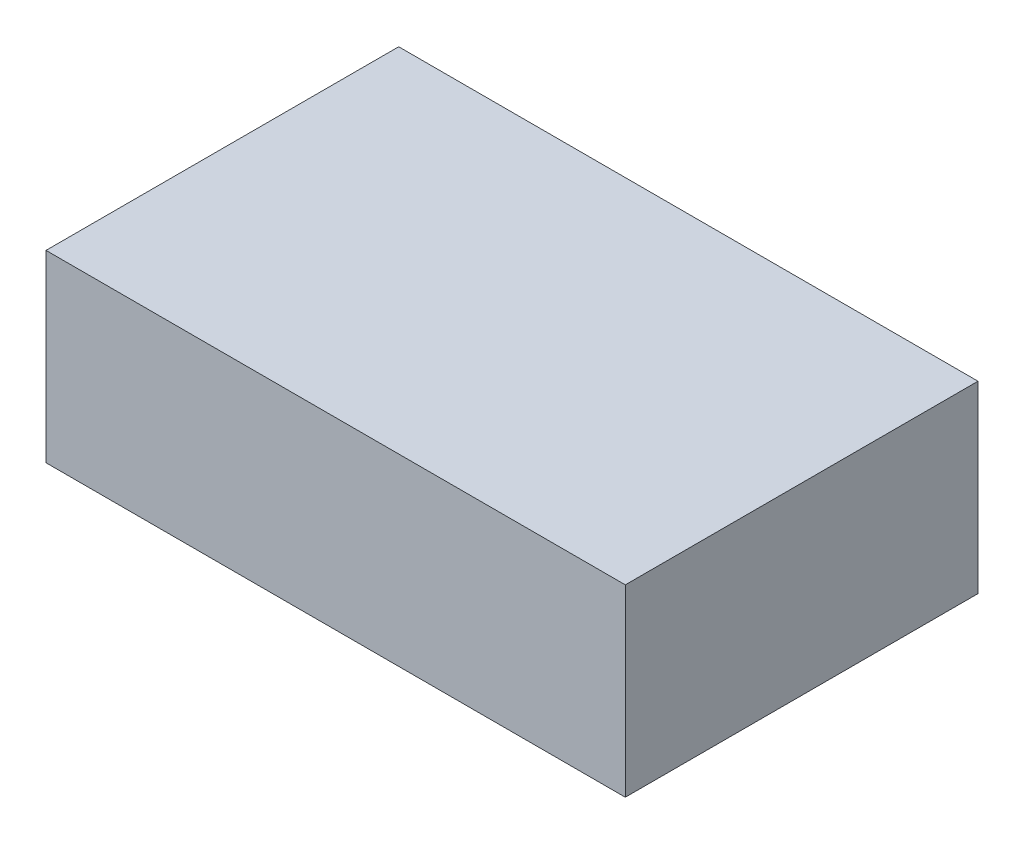
ISO-10303-21;
HEADER;
FILE_DESCRIPTION(('STEP AP214'),'2;1');
FILE_NAME('part.step','',(''),(''),'','','');
FILE_SCHEMA(('AUTOMOTIVE_DESIGN { 1 0 10303 214 1 1 1 1 }'));
ENDSEC;
DATA;
#1=APPLICATION_CONTEXT('core data for automotive mechanical design processes');
#2=APPLICATION_PROTOCOL_DEFINITION('international standard','automotive_design',2000,#1);
#3=PRODUCT_CONTEXT('',#1,'mechanical');
#4=PRODUCT('Part','Part','',(#3));
#5=PRODUCT_RELATED_PRODUCT_CATEGORY('part','',(#4));
#6=PRODUCT_DEFINITION_FORMATION('','',#4);
#7=PRODUCT_DEFINITION_CONTEXT('part definition',#1,'design');
#8=PRODUCT_DEFINITION('design','',#6,#7);
#9=PRODUCT_DEFINITION_SHAPE('','',#8);
#10=(LENGTH_UNIT() NAMED_UNIT(*) SI_UNIT(.MILLI.,.METRE.));
#11=(NAMED_UNIT(*) PLANE_ANGLE_UNIT() SI_UNIT($,.RADIAN.));
#12=(NAMED_UNIT(*) SI_UNIT($,.STERADIAN.) SOLID_ANGLE_UNIT());
#13=UNCERTAINTY_MEASURE_WITH_UNIT(LENGTH_MEASURE(1.E-05),#10,'distance_accuracy_value','');
#14=(GEOMETRIC_REPRESENTATION_CONTEXT(3) GLOBAL_UNCERTAINTY_ASSIGNED_CONTEXT((#13)) GLOBAL_UNIT_ASSIGNED_CONTEXT((#10,
#11,#12)) REPRESENTATION_CONTEXT('',''));
#15=CARTESIAN_POINT('',(0.,0.,0.));
#16=DIRECTION('',(0.,0.,1.));
#17=DIRECTION('',(1.,0.,0.));
#18=AXIS2_PLACEMENT_3D('',#15,#16,#17);
#19=CARTESIAN_POINT('',(-79.9871898393354,50.8,-48.6968642804245));
#20=DIRECTION('',(1.,0.,0.));
#21=DIRECTION('',(0.,0.,-1.));
#22=AXIS2_PLACEMENT_3D('',#19,#20,#21);
#23=PLANE('',#22);
#24=DIRECTION('',(0.,0.,1.));
#25=VECTOR('',#24,1.);
#26=CARTESIAN_POINT('',(-79.9871898393354,0.,-48.6968642804245));
#27=LINE('',#26,#25);
#28=CARTESIAN_POINT('',(-79.9871898393354,0.,-48.6968642804245));
#29=VERTEX_POINT('',#28);
#30=CARTESIAN_POINT('',(-79.9871898393354,0.,48.6968642804245));
#31=VERTEX_POINT('',#30);
#32=EDGE_CURVE('E102',#29,#31,#27,.T.);
#33=ORIENTED_EDGE('',*,*,#32,.T.);
#34=DIRECTION('',(0.,-1.,0.));
#35=VECTOR('',#34,1.);
#36=CARTESIAN_POINT('',(-79.9871898393354,50.8,48.6968642804245));
#37=LINE('',#36,#35);
#38=CARTESIAN_POINT('',(-79.9871898393354,50.8,48.6968642804245));
#39=VERTEX_POINT('',#38);
#40=EDGE_CURVE('E11',#39,#31,#37,.T.);
#41=ORIENTED_EDGE('',*,*,#40,.F.);
#42=DIRECTION('',(0.,0.,1.));
#43=VECTOR('',#42,1.);
#44=CARTESIAN_POINT('',(-79.9871898393354,50.8,-48.6968642804245));
#45=LINE('',#44,#43);
#46=CARTESIAN_POINT('',(-79.9871898393354,50.8,-48.6968642804245));
#47=VERTEX_POINT('',#46);
#48=EDGE_CURVE('E88',#47,#39,#45,.T.);
#49=ORIENTED_EDGE('',*,*,#48,.F.);
#50=DIRECTION('',(0.,-1.,0.));
#51=VECTOR('',#50,1.);
#52=CARTESIAN_POINT('',(-79.9871898393354,50.8,-48.6968642804245));
#53=LINE('',#52,#51);
#54=EDGE_CURVE('E55',#47,#29,#53,.T.);
#55=ORIENTED_EDGE('',*,*,#54,.T.);
#56=EDGE_LOOP('',(#33,#41,#49,#55));
#57=FACE_BOUND('',#56,.T.);
#58=ADVANCED_FACE('F39',(#57),#23,.F.);
#59=CARTESIAN_POINT('',(-79.9871898393354,50.8,48.6968642804245));
#60=DIRECTION('',(0.,0.,-1.));
#61=DIRECTION('',(-1.,0.,0.));
#62=AXIS2_PLACEMENT_3D('',#59,#60,#61);
#63=PLANE('',#62);
#64=DIRECTION('',(1.,0.,0.));
#65=VECTOR('',#64,1.);
#66=CARTESIAN_POINT('',(-79.9871898393354,0.,48.6968642804245));
#67=LINE('',#66,#65);
#68=CARTESIAN_POINT('',(79.9871898393354,0.,48.6968642804245));
#69=VERTEX_POINT('',#68);
#70=EDGE_CURVE('E93',#31,#69,#67,.T.);
#71=ORIENTED_EDGE('',*,*,#70,.T.);
#72=DIRECTION('',(0.,-1.,0.));
#73=VECTOR('',#72,1.);
#74=CARTESIAN_POINT('',(79.9871898393354,50.8,48.6968642804245));
#75=LINE('',#74,#73);
#76=CARTESIAN_POINT('',(79.9871898393354,50.8,48.6968642804245));
#77=VERTEX_POINT('',#76);
#78=EDGE_CURVE('E47',#77,#69,#75,.T.);
#79=ORIENTED_EDGE('',*,*,#78,.F.);
#80=DIRECTION('',(1.,0.,0.));
#81=VECTOR('',#80,1.);
#82=CARTESIAN_POINT('',(-79.9871898393354,50.8,48.6968642804245));
#83=LINE('',#82,#81);
#84=EDGE_CURVE('E80',#39,#77,#83,.T.);
#85=ORIENTED_EDGE('',*,*,#84,.F.);
#86=ORIENTED_EDGE('',*,*,#40,.T.);
#87=EDGE_LOOP('',(#71,#79,#85,#86));
#88=FACE_BOUND('',#87,.T.);
#89=ADVANCED_FACE('F92',(#88),#63,.F.);
#90=CARTESIAN_POINT('',(79.9871898393354,50.8,-48.6968642804245));
#91=DIRECTION('',(1.,0.,0.));
#92=DIRECTION('',(0.,0.,-1.));
#93=AXIS2_PLACEMENT_3D('',#90,#91,#92);
#94=PLANE('',#93);
#95=DIRECTION('',(0.,0.,1.));
#96=VECTOR('',#95,1.);
#97=CARTESIAN_POINT('',(79.9871898393354,0.,-48.6968642804245));
#98=LINE('',#97,#96);
#99=CARTESIAN_POINT('',(79.9871898393354,0.,-48.6968642804245));
#100=VERTEX_POINT('',#99);
#101=EDGE_CURVE('E105',#100,#69,#98,.T.);
#102=ORIENTED_EDGE('',*,*,#101,.F.);
#103=DIRECTION('',(0.,-1.,0.));
#104=VECTOR('',#103,1.);
#105=CARTESIAN_POINT('',(79.9871898393354,50.8,-48.6968642804245));
#106=LINE('',#105,#104);
#107=CARTESIAN_POINT('',(79.9871898393354,50.8,-48.6968642804245));
#108=VERTEX_POINT('',#107);
#109=EDGE_CURVE('E69',#108,#100,#106,.T.);
#110=ORIENTED_EDGE('',*,*,#109,.F.);
#111=DIRECTION('',(0.,0.,1.));
#112=VECTOR('',#111,1.);
#113=CARTESIAN_POINT('',(79.9871898393354,50.8,-48.6968642804245));
#114=LINE('',#113,#112);
#115=EDGE_CURVE('E87',#108,#77,#114,.T.);
#116=ORIENTED_EDGE('',*,*,#115,.T.);
#117=ORIENTED_EDGE('',*,*,#78,.T.);
#118=EDGE_LOOP('',(#102,#110,#116,#117));
#119=FACE_BOUND('',#118,.T.);
#120=ADVANCED_FACE('F96',(#119),#94,.T.);
#121=CARTESIAN_POINT('',(-79.9871898393354,50.8,-48.6968642804245));
#122=DIRECTION('',(0.,0.,-1.));
#123=DIRECTION('',(-1.,0.,0.));
#124=AXIS2_PLACEMENT_3D('',#121,#122,#123);
#125=PLANE('',#124);
#126=DIRECTION('',(1.,0.,0.));
#127=VECTOR('',#126,1.);
#128=CARTESIAN_POINT('',(-79.9871898393354,0.,-48.6968642804245));
#129=LINE('',#128,#127);
#130=EDGE_CURVE('E107',#29,#100,#129,.T.);
#131=ORIENTED_EDGE('',*,*,#130,.F.);
#132=ORIENTED_EDGE('',*,*,#54,.F.);
#133=DIRECTION('',(1.,0.,0.));
#134=VECTOR('',#133,1.);
#135=CARTESIAN_POINT('',(-79.9871898393354,50.8,-48.6968642804245));
#136=LINE('',#135,#134);
#137=EDGE_CURVE('E97',#47,#108,#136,.T.);
#138=ORIENTED_EDGE('',*,*,#137,.T.);
#139=ORIENTED_EDGE('',*,*,#109,.T.);
#140=EDGE_LOOP('',(#131,#132,#138,#139));
#141=FACE_BOUND('',#140,.T.);
#142=ADVANCED_FACE('F113',(#141),#125,.T.);
#143=CARTESIAN_POINT('',(0.,50.8,0.));
#144=DIRECTION('',(0.,1.,0.));
#145=DIRECTION('',(0.,0.,1.));
#146=AXIS2_PLACEMENT_3D('',#143,#144,#145);
#147=PLANE('',#146);
#148=ORIENTED_EDGE('',*,*,#48,.T.);
#149=ORIENTED_EDGE('',*,*,#84,.T.);
#150=ORIENTED_EDGE('',*,*,#115,.F.);
#151=ORIENTED_EDGE('',*,*,#137,.F.);
#152=EDGE_LOOP('',(#148,#149,#150,#151));
#153=FACE_BOUND('',#152,.T.);
#154=ADVANCED_FACE('F84',(#153),#147,.T.);
#155=CARTESIAN_POINT('',(0.,0.,0.));
#156=DIRECTION('',(0.,1.,0.));
#157=DIRECTION('',(0.,0.,1.));
#158=AXIS2_PLACEMENT_3D('',#155,#156,#157);
#159=PLANE('',#158);
#160=ORIENTED_EDGE('',*,*,#32,.F.);
#161=ORIENTED_EDGE('',*,*,#130,.T.);
#162=ORIENTED_EDGE('',*,*,#101,.T.);
#163=ORIENTED_EDGE('',*,*,#70,.F.);
#164=EDGE_LOOP('',(#160,#161,#162,#163));
#165=FACE_BOUND('',#164,.T.);
#166=ADVANCED_FACE('F112',(#165),#159,.F.);
#167=CLOSED_SHELL('',(#58,#89,#120,#142,#154,#166));
#168=MANIFOLD_SOLID_BREP('B2',#167);
#169=ADVANCED_BREP_SHAPE_REPRESENTATION('',(#18,#168),#14);
#170=SHAPE_DEFINITION_REPRESENTATION(#9,#169);
ENDSEC;
END-ISO-10303-21;
